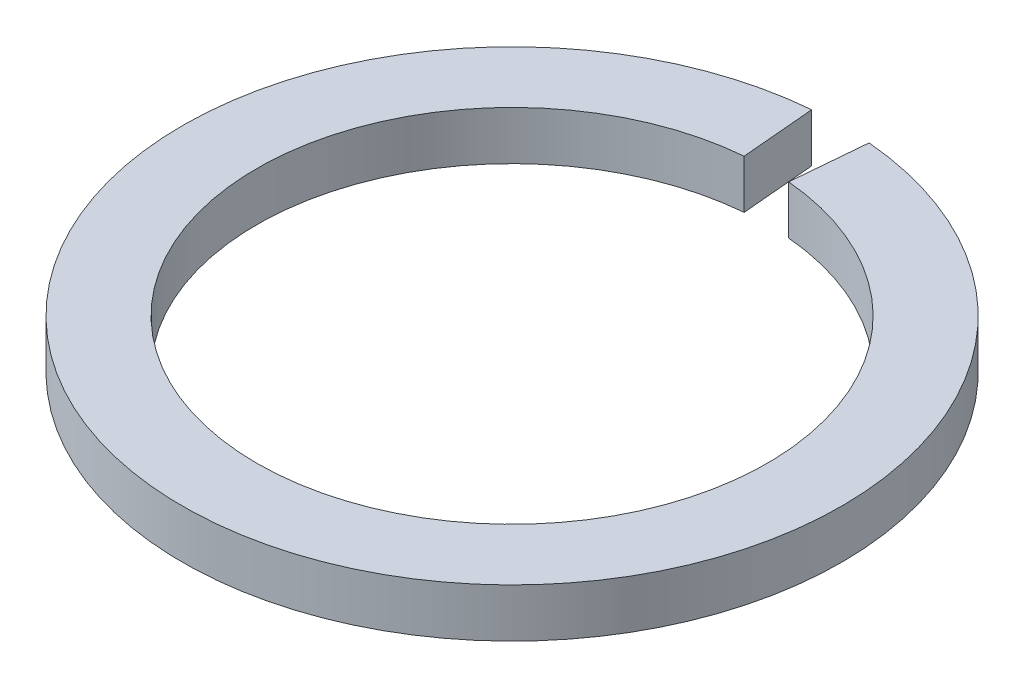
ISO-10303-21;
HEADER;
FILE_DESCRIPTION(('STEP AP214'),'2;1');
FILE_NAME('part.step','',(''),(''),'','','');
FILE_SCHEMA(('AUTOMOTIVE_DESIGN { 1 0 10303 214 1 1 1 1 }'));
ENDSEC;
DATA;
#1=APPLICATION_CONTEXT('core data for automotive mechanical design processes');
#2=APPLICATION_PROTOCOL_DEFINITION('international standard','automotive_design',2000,#1);
#3=PRODUCT_CONTEXT('',#1,'mechanical');
#4=PRODUCT('Part','Part','',(#3));
#5=PRODUCT_RELATED_PRODUCT_CATEGORY('part','',(#4));
#6=PRODUCT_DEFINITION_FORMATION('','',#4);
#7=PRODUCT_DEFINITION_CONTEXT('part definition',#1,'design');
#8=PRODUCT_DEFINITION('design','',#6,#7);
#9=PRODUCT_DEFINITION_SHAPE('','',#8);
#10=(LENGTH_UNIT() NAMED_UNIT(*) SI_UNIT(.MILLI.,.METRE.));
#11=(NAMED_UNIT(*) PLANE_ANGLE_UNIT() SI_UNIT($,.RADIAN.));
#12=(NAMED_UNIT(*) SI_UNIT($,.STERADIAN.) SOLID_ANGLE_UNIT());
#13=UNCERTAINTY_MEASURE_WITH_UNIT(LENGTH_MEASURE(1.E-05),#10,'distance_accuracy_value','');
#14=(GEOMETRIC_REPRESENTATION_CONTEXT(3) GLOBAL_UNCERTAINTY_ASSIGNED_CONTEXT((#13)) GLOBAL_UNIT_ASSIGNED_CONTEXT((#10,
#11,#12)) REPRESENTATION_CONTEXT('',''));
#15=CARTESIAN_POINT('',(0.,0.,0.));
#16=DIRECTION('',(0.,0.,1.));
#17=DIRECTION('',(1.,0.,0.));
#18=AXIS2_PLACEMENT_3D('',#15,#16,#17);
#19=CARTESIAN_POINT('',(0.,0.4953,0.));
#20=DIRECTION('',(0.,1.,0.));
#21=DIRECTION('',(0.,0.,-1.));
#22=AXIS2_PLACEMENT_3D('',#19,#20,#21);
#23=CYLINDRICAL_SURFACE('',#22,5.19430000000003);
#24=DIRECTION('',(0.,-1.,0.));
#25=VECTOR('',#24,1.);
#26=CARTESIAN_POINT('',(0.452713074554161,0.4953,-5.17453412029801));
#27=LINE('',#26,#25);
#28=CARTESIAN_POINT('',(0.452713074554161,0.4953,-5.17453412029801));
#29=VERTEX_POINT('',#28);
#30=CARTESIAN_POINT('',(0.452713074554161,-0.4953,-5.17453412029801));
#31=VERTEX_POINT('',#30);
#32=EDGE_CURVE('E11',#29,#31,#27,.T.);
#33=ORIENTED_EDGE('',*,*,#32,.T.);
#34=CARTESIAN_POINT('',(0.,-0.4953,0.));
#35=DIRECTION('',(0.,1.,0.));
#36=DIRECTION('',(1.,0.,0.));
#37=AXIS2_PLACEMENT_3D('',#34,#35,#36);
#38=CIRCLE('',#37,5.19430000000003);
#39=CARTESIAN_POINT('',(-0.452713074554158,-0.4953,-5.17453412029801));
#40=VERTEX_POINT('',#39);
#41=EDGE_CURVE('E25',#40,#31,#38,.T.);
#42=ORIENTED_EDGE('',*,*,#41,.F.);
#43=DIRECTION('',(0.,-1.,0.));
#44=VECTOR('',#43,1.);
#45=CARTESIAN_POINT('',(-0.452713074554158,0.4953,-5.17453412029801));
#46=LINE('',#45,#44);
#47=CARTESIAN_POINT('',(-0.452713074554158,0.4953,-5.17453412029801));
#48=VERTEX_POINT('',#47);
#49=EDGE_CURVE('E69',#48,#40,#46,.T.);
#50=ORIENTED_EDGE('',*,*,#49,.F.);
#51=CARTESIAN_POINT('',(0.,0.4953,0.));
#52=DIRECTION('',(0.,1.,0.));
#53=DIRECTION('',(1.,0.,0.));
#54=AXIS2_PLACEMENT_3D('',#51,#52,#53);
#55=CIRCLE('',#54,5.19430000000003);
#56=EDGE_CURVE('E98',#48,#29,#55,.T.);
#57=ORIENTED_EDGE('',*,*,#56,.T.);
#58=EDGE_LOOP('',(#33,#42,#50,#57));
#59=FACE_BOUND('',#58,.T.);
#60=ADVANCED_FACE('F17',(#59),#23,.F.);
#61=CARTESIAN_POINT('',(0.,0.4953,0.));
#62=DIRECTION('',(0.,1.,0.));
#63=DIRECTION('',(0.,0.,1.));
#64=AXIS2_PLACEMENT_3D('',#61,#62,#63);
#65=PLANE('',#64);
#66=DIRECTION('',(-0.0871557427476642,0.,-0.996194698091745));
#67=VECTOR('',#66,1.);
#68=CARTESIAN_POINT('',(-0.452713074554161,0.4953,-5.17453412029801));
#69=LINE('',#68,#67);
#70=CARTESIAN_POINT('',(-0.5844315485687,0.4953,-6.68008316752399));
#71=VERTEX_POINT('',#70);
#72=EDGE_CURVE('E94',#48,#71,#69,.T.);
#73=ORIENTED_EDGE('',*,*,#72,.T.);
#74=CARTESIAN_POINT('',(0.,0.4953,0.));
#75=DIRECTION('',(0.,1.,0.));
#76=DIRECTION('',(1.,0.,0.));
#77=AXIS2_PLACEMENT_3D('',#74,#75,#76);
#78=CIRCLE('',#77,6.7056);
#79=CARTESIAN_POINT('',(0.584431548568695,0.4953,-6.68008316752399));
#80=VERTEX_POINT('',#79);
#81=EDGE_CURVE('E62',#71,#80,#78,.T.);
#82=ORIENTED_EDGE('',*,*,#81,.T.);
#83=DIRECTION('',(-0.0871557427476642,0.,0.996194698091745));
#84=VECTOR('',#83,1.);
#85=CARTESIAN_POINT('',(0.5844315485687,0.4953,-6.68008316752399));
#86=LINE('',#85,#84);
#87=EDGE_CURVE('E85',#80,#29,#86,.T.);
#88=ORIENTED_EDGE('',*,*,#87,.T.);
#89=ORIENTED_EDGE('',*,*,#56,.F.);
#90=EDGE_LOOP('',(#73,#82,#88,#89));
#91=FACE_BOUND('',#90,.T.);
#92=ADVANCED_FACE('F112',(#91),#65,.T.);
#93=CARTESIAN_POINT('',(0.5844315485687,0.4953,-6.68008316752399));
#94=DIRECTION('',(0.996194698091745,0.,0.0871557427476642));
#95=DIRECTION('',(0.0871557427476642,0.,-0.996194698091745));
#96=AXIS2_PLACEMENT_3D('',#93,#94,#95);
#97=PLANE('',#96);
#98=DIRECTION('',(-0.0871557427476642,0.,0.996194698091745));
#99=VECTOR('',#98,1.);
#100=CARTESIAN_POINT('',(0.5844315485687,-0.4953,-6.68008316752399));
#101=LINE('',#100,#99);
#102=CARTESIAN_POINT('',(0.584431548568695,-0.4953,-6.68008316752399));
#103=VERTEX_POINT('',#102);
#104=EDGE_CURVE('E73',#103,#31,#101,.T.);
#105=ORIENTED_EDGE('',*,*,#104,.T.);
#106=ORIENTED_EDGE('',*,*,#32,.F.);
#107=ORIENTED_EDGE('',*,*,#87,.F.);
#108=DIRECTION('',(0.,-1.,0.));
#109=VECTOR('',#108,1.);
#110=CARTESIAN_POINT('',(0.584431548568695,0.4953,-6.68008316752399));
#111=LINE('',#110,#109);
#112=EDGE_CURVE('E74',#80,#103,#111,.T.);
#113=ORIENTED_EDGE('',*,*,#112,.T.);
#114=EDGE_LOOP('',(#105,#106,#107,#113));
#115=FACE_BOUND('',#114,.T.);
#116=ADVANCED_FACE('F114',(#115),#97,.F.);
#117=CARTESIAN_POINT('',(0.,0.4953,0.));
#118=DIRECTION('',(0.,1.,0.));
#119=DIRECTION('',(0.,0.,-1.));
#120=AXIS2_PLACEMENT_3D('',#117,#118,#119);
#121=CYLINDRICAL_SURFACE('',#120,6.7056);
#122=CARTESIAN_POINT('',(0.,-0.4953,0.));
#123=DIRECTION('',(0.,1.,0.));
#124=DIRECTION('',(1.,0.,0.));
#125=AXIS2_PLACEMENT_3D('',#122,#123,#124);
#126=CIRCLE('',#125,6.7056);
#127=CARTESIAN_POINT('',(-0.5844315485687,-0.4953,-6.68008316752399));
#128=VERTEX_POINT('',#127);
#129=EDGE_CURVE('E60',#128,#103,#126,.T.);
#130=ORIENTED_EDGE('',*,*,#129,.T.);
#131=ORIENTED_EDGE('',*,*,#112,.F.);
#132=ORIENTED_EDGE('',*,*,#81,.F.);
#133=DIRECTION('',(0.,-1.,0.));
#134=VECTOR('',#133,1.);
#135=CARTESIAN_POINT('',(-0.5844315485687,0.4953,-6.68008316752399));
#136=LINE('',#135,#134);
#137=EDGE_CURVE('E55',#71,#128,#136,.T.);
#138=ORIENTED_EDGE('',*,*,#137,.T.);
#139=EDGE_LOOP('',(#130,#131,#132,#138));
#140=FACE_BOUND('',#139,.T.);
#141=ADVANCED_FACE('F57',(#140),#121,.T.);
#142=CARTESIAN_POINT('',(-0.452713074554161,0.4953,-5.17453412029801));
#143=DIRECTION('',(-0.996194698091745,0.,0.0871557427476642));
#144=DIRECTION('',(0.0871557427476642,0.,0.996194698091745));
#145=AXIS2_PLACEMENT_3D('',#142,#143,#144);
#146=PLANE('',#145);
#147=DIRECTION('',(-0.0871557427476642,0.,-0.996194698091745));
#148=VECTOR('',#147,1.);
#149=CARTESIAN_POINT('',(-0.452713074554161,-0.4953,-5.17453412029801));
#150=LINE('',#149,#148);
#151=EDGE_CURVE('E65',#40,#128,#150,.T.);
#152=ORIENTED_EDGE('',*,*,#151,.T.);
#153=ORIENTED_EDGE('',*,*,#137,.F.);
#154=ORIENTED_EDGE('',*,*,#72,.F.);
#155=ORIENTED_EDGE('',*,*,#49,.T.);
#156=EDGE_LOOP('',(#152,#153,#154,#155));
#157=FACE_BOUND('',#156,.T.);
#158=ADVANCED_FACE('F68',(#157),#146,.F.);
#159=CARTESIAN_POINT('',(0.,-0.4953,0.));
#160=DIRECTION('',(0.,1.,0.));
#161=DIRECTION('',(0.,0.,1.));
#162=AXIS2_PLACEMENT_3D('',#159,#160,#161);
#163=PLANE('',#162);
#164=ORIENTED_EDGE('',*,*,#151,.F.);
#165=ORIENTED_EDGE('',*,*,#41,.T.);
#166=ORIENTED_EDGE('',*,*,#104,.F.);
#167=ORIENTED_EDGE('',*,*,#129,.F.);
#168=EDGE_LOOP('',(#164,#165,#166,#167));
#169=FACE_BOUND('',#168,.T.);
#170=ADVANCED_FACE('F72',(#169),#163,.F.);
#171=CLOSED_SHELL('',(#60,#92,#116,#141,#158,#170));
#172=MANIFOLD_SOLID_BREP('B1',#171);
#173=ADVANCED_BREP_SHAPE_REPRESENTATION('',(#18,#172),#14);
#174=SHAPE_DEFINITION_REPRESENTATION(#9,#173);
ENDSEC;
END-ISO-10303-21;
